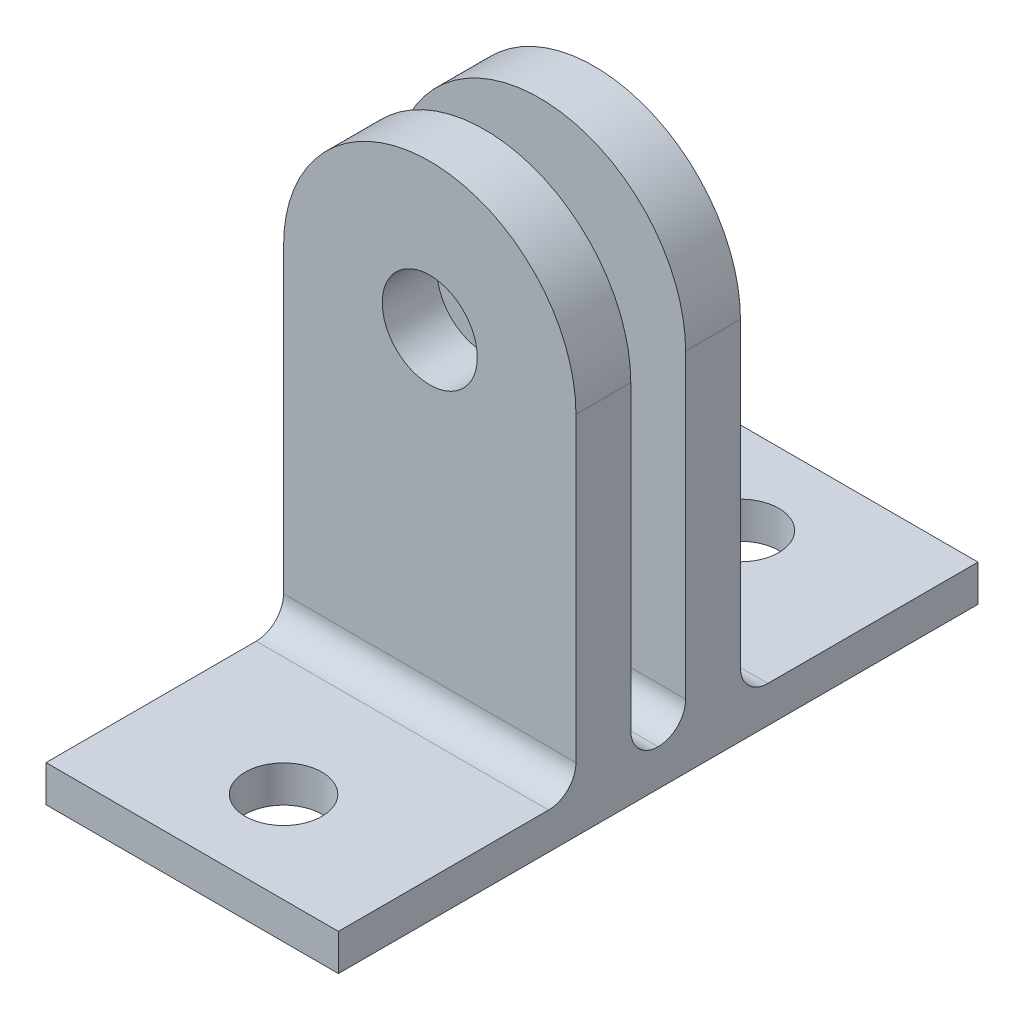
ISO-10303-21;
HEADER;
FILE_DESCRIPTION(('STEP AP214'),'2;1');
FILE_NAME('part.step','',(''),(''),'','','');
FILE_SCHEMA(('AUTOMOTIVE_DESIGN { 1 0 10303 214 1 1 1 1 }'));
ENDSEC;
DATA;
#1=APPLICATION_CONTEXT('core data for automotive mechanical design processes');
#2=APPLICATION_PROTOCOL_DEFINITION('international standard','automotive_design',2000,#1);
#3=PRODUCT_CONTEXT('',#1,'mechanical');
#4=PRODUCT('Part','Part','',(#3));
#5=PRODUCT_RELATED_PRODUCT_CATEGORY('part','',(#4));
#6=PRODUCT_DEFINITION_FORMATION('','',#4);
#7=PRODUCT_DEFINITION_CONTEXT('part definition',#1,'design');
#8=PRODUCT_DEFINITION('design','',#6,#7);
#9=PRODUCT_DEFINITION_SHAPE('','',#8);
#10=(LENGTH_UNIT() NAMED_UNIT(*) SI_UNIT(.MILLI.,.METRE.));
#11=(NAMED_UNIT(*) PLANE_ANGLE_UNIT() SI_UNIT($,.RADIAN.));
#12=(NAMED_UNIT(*) SI_UNIT($,.STERADIAN.) SOLID_ANGLE_UNIT());
#13=UNCERTAINTY_MEASURE_WITH_UNIT(LENGTH_MEASURE(1.E-05),#10,'distance_accuracy_value','');
#14=(GEOMETRIC_REPRESENTATION_CONTEXT(3) GLOBAL_UNCERTAINTY_ASSIGNED_CONTEXT((#13)) GLOBAL_UNIT_ASSIGNED_CONTEXT((#10,
#11,#12)) REPRESENTATION_CONTEXT('',''));
#15=CARTESIAN_POINT('',(0.,0.,0.));
#16=DIRECTION('',(0.,0.,1.));
#17=DIRECTION('',(1.,0.,0.));
#18=AXIS2_PLACEMENT_3D('',#15,#16,#17);
#19=CARTESIAN_POINT('',(0.,2.,0.));
#20=DIRECTION('',(0.,-1.,0.));
#21=DIRECTION('',(0.,0.,-1.));
#22=AXIS2_PLACEMENT_3D('',#19,#20,#21);
#23=PLANE('',#22);
#24=CARTESIAN_POINT('',(0.,2.,-12.5));
#25=DIRECTION('',(0.,1.,0.));
#26=DIRECTION('',(0.,0.,-1.));
#27=AXIS2_PLACEMENT_3D('',#24,#25,#26);
#28=CIRCLE('',#27,2.1);
#29=CARTESIAN_POINT('',(0.,2.,-14.6));
#30=VERTEX_POINT('',#29);
#31=EDGE_CURVE('E522',#30,#30,#28,.T.);
#32=ORIENTED_EDGE('',*,*,#31,.F.);
#33=EDGE_LOOP('',(#32));
#34=FACE_BOUND('',#33,.T.);
#35=DIRECTION('',(0.,0.,1.));
#36=VECTOR('',#35,1.);
#37=CARTESIAN_POINT('',(-8.,2.,17.5));
#38=LINE('',#37,#36);
#39=CARTESIAN_POINT('',(-8.,2.,-17.5));
#40=VERTEX_POINT('',#39);
#41=CARTESIAN_POINT('',(-8.,2.,-6.));
#42=VERTEX_POINT('',#41);
#43=EDGE_CURVE('E207',#40,#42,#38,.T.);
#44=ORIENTED_EDGE('',*,*,#43,.T.);
#45=DIRECTION('',(1.,0.,0.));
#46=VECTOR('',#45,1.);
#47=CARTESIAN_POINT('',(8.,2.,-6.));
#48=LINE('',#47,#46);
#49=CARTESIAN_POINT('',(8.,2.,-6.));
#50=VERTEX_POINT('',#49);
#51=EDGE_CURVE('E238',#42,#50,#48,.T.);
#52=ORIENTED_EDGE('',*,*,#51,.T.);
#53=DIRECTION('',(0.,0.,-1.));
#54=VECTOR('',#53,1.);
#55=CARTESIAN_POINT('',(8.,2.,-17.5));
#56=LINE('',#55,#54);
#57=CARTESIAN_POINT('',(8.,2.,-17.5));
#58=VERTEX_POINT('',#57);
#59=EDGE_CURVE('E212',#50,#58,#56,.T.);
#60=ORIENTED_EDGE('',*,*,#59,.T.);
#61=DIRECTION('',(-1.,0.,0.));
#62=VECTOR('',#61,1.);
#63=CARTESIAN_POINT('',(-8.,2.,-17.5));
#64=LINE('',#63,#62);
#65=EDGE_CURVE('E202',#58,#40,#64,.T.);
#66=ORIENTED_EDGE('',*,*,#65,.T.);
#67=EDGE_LOOP('',(#44,#52,#60,#66));
#68=FACE_BOUND('',#67,.T.);
#69=ADVANCED_FACE('F34',(#34,#68),#23,.F.);
#70=CARTESIAN_POINT('',(0.,2.,12.5));
#71=DIRECTION('',(0.,1.,0.));
#72=DIRECTION('',(0.,0.,1.));
#73=AXIS2_PLACEMENT_3D('',#70,#71,#72);
#74=CIRCLE('',#73,2.1);
#75=CARTESIAN_POINT('',(0.,2.,14.6));
#76=VERTEX_POINT('',#75);
#77=EDGE_CURVE('E516',#76,#76,#74,.T.);
#78=ORIENTED_EDGE('',*,*,#77,.F.);
#79=EDGE_LOOP('',(#78));
#80=FACE_BOUND('',#79,.T.);
#81=CARTESIAN_POINT('',(8.,2.,17.5));
#82=VERTEX_POINT('',#81);
#83=CARTESIAN_POINT('',(8.,2.,6.));
#84=VERTEX_POINT('',#83);
#85=EDGE_CURVE('E213',#82,#84,#56,.T.);
#86=ORIENTED_EDGE('',*,*,#85,.T.);
#87=DIRECTION('',(1.,0.,0.));
#88=VECTOR('',#87,1.);
#89=CARTESIAN_POINT('',(-8.,2.,6.));
#90=LINE('',#89,#88);
#91=CARTESIAN_POINT('',(-8.,2.,6.));
#92=VERTEX_POINT('',#91);
#93=EDGE_CURVE('E245',#84,#92,#90,.F.);
#94=ORIENTED_EDGE('',*,*,#93,.T.);
#95=CARTESIAN_POINT('',(-8.,2.,17.5));
#96=VERTEX_POINT('',#95);
#97=EDGE_CURVE('E205',#92,#96,#38,.T.);
#98=ORIENTED_EDGE('',*,*,#97,.T.);
#99=DIRECTION('',(1.,0.,0.));
#100=VECTOR('',#99,1.);
#101=CARTESIAN_POINT('',(-8.,2.,17.5));
#102=LINE('',#101,#100);
#103=EDGE_CURVE('E210',#96,#82,#102,.T.);
#104=ORIENTED_EDGE('',*,*,#103,.T.);
#105=EDGE_LOOP('',(#86,#94,#98,#104));
#106=FACE_BOUND('',#105,.T.);
#107=ADVANCED_FACE('F305',(#80,#106),#23,.F.);
#108=CARTESIAN_POINT('',(-8.,2.,-17.5));
#109=DIRECTION('',(0.,0.,1.));
#110=DIRECTION('',(1.,0.,0.));
#111=AXIS2_PLACEMENT_3D('',#108,#109,#110);
#112=PLANE('',#111);
#113=DIRECTION('',(-1.,0.,0.));
#114=VECTOR('',#113,1.);
#115=CARTESIAN_POINT('',(-8.,0.,-17.5));
#116=LINE('',#115,#114);
#117=CARTESIAN_POINT('',(8.,0.,-17.5));
#118=VERTEX_POINT('',#117);
#119=CARTESIAN_POINT('',(-8.,0.,-17.5));
#120=VERTEX_POINT('',#119);
#121=EDGE_CURVE('E201',#118,#120,#116,.T.);
#122=ORIENTED_EDGE('',*,*,#121,.T.);
#123=DIRECTION('',(0.,-1.,0.));
#124=VECTOR('',#123,1.);
#125=CARTESIAN_POINT('',(-8.,2.,-17.5));
#126=LINE('',#125,#124);
#127=EDGE_CURVE('E232',#40,#120,#126,.T.);
#128=ORIENTED_EDGE('',*,*,#127,.F.);
#129=ORIENTED_EDGE('',*,*,#65,.F.);
#130=DIRECTION('',(0.,-1.,0.));
#131=VECTOR('',#130,1.);
#132=CARTESIAN_POINT('',(8.,2.,-17.5));
#133=LINE('',#132,#131);
#134=EDGE_CURVE('E216',#58,#118,#133,.T.);
#135=ORIENTED_EDGE('',*,*,#134,.T.);
#136=EDGE_LOOP('',(#122,#128,#129,#135));
#137=FACE_BOUND('',#136,.T.);
#138=ADVANCED_FACE('F289',(#137),#112,.F.);
#139=CARTESIAN_POINT('',(-8.,2.,17.5));
#140=DIRECTION('',(1.,0.,0.));
#141=DIRECTION('',(0.,0.,-1.));
#142=AXIS2_PLACEMENT_3D('',#139,#140,#141);
#143=PLANE('',#142);
#144=DIRECTION('',(0.,0.,1.));
#145=VECTOR('',#144,1.);
#146=CARTESIAN_POINT('',(-8.,0.,17.5));
#147=LINE('',#146,#145);
#148=CARTESIAN_POINT('',(-8.,0.,17.5));
#149=VERTEX_POINT('',#148);
#150=EDGE_CURVE('E219',#120,#149,#147,.T.);
#151=ORIENTED_EDGE('',*,*,#150,.T.);
#152=DIRECTION('',(0.,-1.,0.));
#153=VECTOR('',#152,1.);
#154=CARTESIAN_POINT('',(-8.,2.,17.5));
#155=LINE('',#154,#153);
#156=EDGE_CURVE('E229',#96,#149,#155,.T.);
#157=ORIENTED_EDGE('',*,*,#156,.F.);
#158=ORIENTED_EDGE('',*,*,#97,.F.);
#159=CARTESIAN_POINT('',(-8.,3.5,6.));
#160=DIRECTION('',(1.,0.,0.));
#161=DIRECTION('',(0.,0.,-1.));
#162=AXIS2_PLACEMENT_3D('',#159,#160,#161);
#163=CIRCLE('',#162,1.5);
#164=CARTESIAN_POINT('',(-8.,3.5,4.5));
#165=VERTEX_POINT('',#164);
#166=EDGE_CURVE('E258',#92,#165,#163,.T.);
#167=ORIENTED_EDGE('',*,*,#166,.T.);
#168=DIRECTION('',(0.,-1.,0.));
#169=VECTOR('',#168,1.);
#170=CARTESIAN_POINT('',(-8.,20.,4.5));
#171=LINE('',#170,#169);
#172=CARTESIAN_POINT('',(-8.,20.,4.5));
#173=VERTEX_POINT('',#172);
#174=EDGE_CURVE('E183',#173,#165,#171,.T.);
#175=ORIENTED_EDGE('',*,*,#174,.F.);
#176=DIRECTION('',(0.,0.,-1.));
#177=VECTOR('',#176,1.);
#178=CARTESIAN_POINT('',(-8.,20.,4.5));
#179=LINE('',#178,#177);
#180=CARTESIAN_POINT('',(-8.,20.,1.5));
#181=VERTEX_POINT('',#180);
#182=EDGE_CURVE('E191',#173,#181,#179,.T.);
#183=ORIENTED_EDGE('',*,*,#182,.T.);
#184=DIRECTION('',(0.,-1.,0.));
#185=VECTOR('',#184,1.);
#186=CARTESIAN_POINT('',(-8.,20.,1.5));
#187=LINE('',#186,#185);
#188=CARTESIAN_POINT('',(-8.,3.5,1.5));
#189=VERTEX_POINT('',#188);
#190=EDGE_CURVE('E180',#181,#189,#187,.T.);
#191=ORIENTED_EDGE('',*,*,#190,.T.);
#192=CARTESIAN_POINT('',(-8.,3.5,0.));
#193=DIRECTION('',(1.,0.,0.));
#194=DIRECTION('',(0.,0.,-1.));
#195=AXIS2_PLACEMENT_3D('',#192,#193,#194);
#196=CIRCLE('',#195,1.5);
#197=CARTESIAN_POINT('',(-8.,2.,0.));
#198=VERTEX_POINT('',#197);
#199=EDGE_CURVE('E11',#189,#198,#196,.T.);
#200=ORIENTED_EDGE('',*,*,#199,.T.);
#201=CARTESIAN_POINT('',(-8.,3.5,0.));
#202=DIRECTION('',(1.,0.,0.));
#203=DIRECTION('',(0.,0.,-1.));
#204=AXIS2_PLACEMENT_3D('',#201,#202,#203);
#205=CIRCLE('',#204,1.5);
#206=CARTESIAN_POINT('',(-8.,3.5,-1.5));
#207=VERTEX_POINT('',#206);
#208=EDGE_CURVE('E250',#198,#207,#205,.T.);
#209=ORIENTED_EDGE('',*,*,#208,.T.);
#210=DIRECTION('',(0.,-1.,0.));
#211=VECTOR('',#210,1.);
#212=CARTESIAN_POINT('',(-8.,20.,-1.5));
#213=LINE('',#212,#211);
#214=CARTESIAN_POINT('',(-8.,20.,-1.5));
#215=VERTEX_POINT('',#214);
#216=EDGE_CURVE('E146',#215,#207,#213,.T.);
#217=ORIENTED_EDGE('',*,*,#216,.F.);
#218=DIRECTION('',(0.,0.,1.));
#219=VECTOR('',#218,1.);
#220=CARTESIAN_POINT('',(-8.,20.,-4.5));
#221=LINE('',#220,#219);
#222=CARTESIAN_POINT('',(-8.,20.,-4.5));
#223=VERTEX_POINT('',#222);
#224=EDGE_CURVE('E140',#223,#215,#221,.T.);
#225=ORIENTED_EDGE('',*,*,#224,.F.);
#226=DIRECTION('',(0.,-1.,0.));
#227=VECTOR('',#226,1.);
#228=CARTESIAN_POINT('',(-8.,20.,-4.5));
#229=LINE('',#228,#227);
#230=CARTESIAN_POINT('',(-8.,3.5,-4.5));
#231=VERTEX_POINT('',#230);
#232=EDGE_CURVE('E143',#223,#231,#229,.T.);
#233=ORIENTED_EDGE('',*,*,#232,.T.);
#234=CARTESIAN_POINT('',(-8.,3.5,-6.));
#235=DIRECTION('',(1.,0.,0.));
#236=DIRECTION('',(0.,0.,-1.));
#237=AXIS2_PLACEMENT_3D('',#234,#235,#236);
#238=CIRCLE('',#237,1.5);
#239=EDGE_CURVE('E254',#231,#42,#238,.T.);
#240=ORIENTED_EDGE('',*,*,#239,.T.);
#241=ORIENTED_EDGE('',*,*,#43,.F.);
#242=ORIENTED_EDGE('',*,*,#127,.T.);
#243=EDGE_LOOP('',(#151,#157,#158,#167,#175,#183,#191,#200,#209,#217,#225,#233,#240,#241,#242));
#244=FACE_BOUND('',#243,.T.);
#245=ADVANCED_FACE('F142',(#244),#143,.F.);
#246=CARTESIAN_POINT('',(-8.,2.,17.5));
#247=DIRECTION('',(0.,0.,-1.));
#248=DIRECTION('',(-1.,0.,0.));
#249=AXIS2_PLACEMENT_3D('',#246,#247,#248);
#250=PLANE('',#249);
#251=DIRECTION('',(1.,0.,0.));
#252=VECTOR('',#251,1.);
#253=CARTESIAN_POINT('',(-8.,0.,17.5));
#254=LINE('',#253,#252);
#255=CARTESIAN_POINT('',(8.,0.,17.5));
#256=VERTEX_POINT('',#255);
#257=EDGE_CURVE('E221',#149,#256,#254,.T.);
#258=ORIENTED_EDGE('',*,*,#257,.T.);
#259=DIRECTION('',(0.,-1.,0.));
#260=VECTOR('',#259,1.);
#261=CARTESIAN_POINT('',(8.,2.,17.5));
#262=LINE('',#261,#260);
#263=EDGE_CURVE('E226',#82,#256,#262,.T.);
#264=ORIENTED_EDGE('',*,*,#263,.F.);
#265=ORIENTED_EDGE('',*,*,#103,.F.);
#266=ORIENTED_EDGE('',*,*,#156,.T.);
#267=EDGE_LOOP('',(#258,#264,#265,#266));
#268=FACE_BOUND('',#267,.T.);
#269=ADVANCED_FACE('F297',(#268),#250,.F.);
#270=CARTESIAN_POINT('',(8.,2.,-17.5));
#271=DIRECTION('',(-1.,0.,0.));
#272=DIRECTION('',(0.,0.,1.));
#273=AXIS2_PLACEMENT_3D('',#270,#271,#272);
#274=PLANE('',#273);
#275=DIRECTION('',(0.,0.,-1.));
#276=VECTOR('',#275,1.);
#277=CARTESIAN_POINT('',(8.,0.,-17.5));
#278=LINE('',#277,#276);
#279=EDGE_CURVE('E206',#256,#118,#278,.T.);
#280=ORIENTED_EDGE('',*,*,#279,.T.);
#281=ORIENTED_EDGE('',*,*,#134,.F.);
#282=ORIENTED_EDGE('',*,*,#59,.F.);
#283=CARTESIAN_POINT('',(8.,3.5,-6.));
#284=DIRECTION('',(-1.,0.,0.));
#285=DIRECTION('',(0.,0.,1.));
#286=AXIS2_PLACEMENT_3D('',#283,#284,#285);
#287=CIRCLE('',#286,1.5);
#288=CARTESIAN_POINT('',(8.,3.5,-4.5));
#289=VERTEX_POINT('',#288);
#290=EDGE_CURVE('E252',#50,#289,#287,.T.);
#291=ORIENTED_EDGE('',*,*,#290,.T.);
#292=DIRECTION('',(0.,1.,0.));
#293=VECTOR('',#292,1.);
#294=CARTESIAN_POINT('',(8.,20.,-4.5));
#295=LINE('',#294,#293);
#296=CARTESIAN_POINT('',(8.,20.,-4.5));
#297=VERTEX_POINT('',#296);
#298=EDGE_CURVE('E166',#289,#297,#295,.T.);
#299=ORIENTED_EDGE('',*,*,#298,.T.);
#300=DIRECTION('',(0.,0.,1.));
#301=VECTOR('',#300,1.);
#302=CARTESIAN_POINT('',(8.,20.,-4.5));
#303=LINE('',#302,#301);
#304=CARTESIAN_POINT('',(8.,20.,-1.5));
#305=VERTEX_POINT('',#304);
#306=EDGE_CURVE('E152',#297,#305,#303,.T.);
#307=ORIENTED_EDGE('',*,*,#306,.T.);
#308=DIRECTION('',(0.,1.,0.));
#309=VECTOR('',#308,1.);
#310=CARTESIAN_POINT('',(8.,20.,-1.5));
#311=LINE('',#310,#309);
#312=CARTESIAN_POINT('',(8.,3.5,-1.5));
#313=VERTEX_POINT('',#312);
#314=EDGE_CURVE('E161',#313,#305,#311,.T.);
#315=ORIENTED_EDGE('',*,*,#314,.F.);
#316=CARTESIAN_POINT('',(8.,3.5,0.));
#317=DIRECTION('',(-1.,0.,0.));
#318=DIRECTION('',(0.,0.,1.));
#319=AXIS2_PLACEMENT_3D('',#316,#317,#318);
#320=CIRCLE('',#319,1.5);
#321=CARTESIAN_POINT('',(8.,2.,0.));
#322=VERTEX_POINT('',#321);
#323=EDGE_CURVE('E56',#313,#322,#320,.T.);
#324=ORIENTED_EDGE('',*,*,#323,.T.);
#325=CARTESIAN_POINT('',(8.,3.5,0.));
#326=DIRECTION('',(-1.,0.,0.));
#327=DIRECTION('',(0.,0.,1.));
#328=AXIS2_PLACEMENT_3D('',#325,#326,#327);
#329=CIRCLE('',#328,1.5);
#330=CARTESIAN_POINT('',(8.,3.5,1.5));
#331=VERTEX_POINT('',#330);
#332=EDGE_CURVE('E43',#322,#331,#329,.T.);
#333=ORIENTED_EDGE('',*,*,#332,.T.);
#334=DIRECTION('',(0.,1.,0.));
#335=VECTOR('',#334,1.);
#336=CARTESIAN_POINT('',(8.,20.,1.5));
#337=LINE('',#336,#335);
#338=CARTESIAN_POINT('',(8.,20.,1.5));
#339=VERTEX_POINT('',#338);
#340=EDGE_CURVE('E193',#331,#339,#337,.T.);
#341=ORIENTED_EDGE('',*,*,#340,.T.);
#342=DIRECTION('',(0.,0.,-1.));
#343=VECTOR('',#342,1.);
#344=CARTESIAN_POINT('',(8.,20.,4.5));
#345=LINE('',#344,#343);
#346=CARTESIAN_POINT('',(8.,20.,4.5));
#347=VERTEX_POINT('',#346);
#348=EDGE_CURVE('E198',#347,#339,#345,.T.);
#349=ORIENTED_EDGE('',*,*,#348,.F.);
#350=DIRECTION('',(0.,1.,0.));
#351=VECTOR('',#350,1.);
#352=CARTESIAN_POINT('',(8.,20.,4.5));
#353=LINE('',#352,#351);
#354=CARTESIAN_POINT('',(8.,3.5,4.5));
#355=VERTEX_POINT('',#354);
#356=EDGE_CURVE('E186',#355,#347,#353,.T.);
#357=ORIENTED_EDGE('',*,*,#356,.F.);
#358=CARTESIAN_POINT('',(8.,3.5,6.));
#359=DIRECTION('',(-1.,0.,0.));
#360=DIRECTION('',(0.,0.,1.));
#361=AXIS2_PLACEMENT_3D('',#358,#359,#360);
#362=CIRCLE('',#361,1.5);
#363=EDGE_CURVE('E256',#355,#84,#362,.T.);
#364=ORIENTED_EDGE('',*,*,#363,.T.);
#365=ORIENTED_EDGE('',*,*,#85,.F.);
#366=ORIENTED_EDGE('',*,*,#263,.T.);
#367=EDGE_LOOP('',(#280,#281,#282,#291,#299,#307,#315,#324,#333,#341,#349,#357,#364,#365,#366));
#368=FACE_BOUND('',#367,.T.);
#369=ADVANCED_FACE('F261',(#368),#274,.F.);
#370=CARTESIAN_POINT('',(0.,0.,0.));
#371=DIRECTION('',(0.,-1.,0.));
#372=DIRECTION('',(0.,0.,-1.));
#373=AXIS2_PLACEMENT_3D('',#370,#371,#372);
#374=PLANE('',#373);
#375=CARTESIAN_POINT('',(0.,0.,-12.5));
#376=DIRECTION('',(0.,1.,0.));
#377=DIRECTION('',(0.,0.,-1.));
#378=AXIS2_PLACEMENT_3D('',#375,#376,#377);
#379=CIRCLE('',#378,2.1);
#380=CARTESIAN_POINT('',(0.,0.,-14.6));
#381=VERTEX_POINT('',#380);
#382=EDGE_CURVE('E519',#381,#381,#379,.T.);
#383=ORIENTED_EDGE('',*,*,#382,.T.);
#384=EDGE_LOOP('',(#383));
#385=FACE_BOUND('',#384,.T.);
#386=CARTESIAN_POINT('',(0.,0.,12.5));
#387=DIRECTION('',(0.,1.,0.));
#388=DIRECTION('',(0.,0.,1.));
#389=AXIS2_PLACEMENT_3D('',#386,#387,#388);
#390=CIRCLE('',#389,2.1);
#391=CARTESIAN_POINT('',(0.,0.,14.6));
#392=VERTEX_POINT('',#391);
#393=EDGE_CURVE('E275',#392,#392,#390,.T.);
#394=ORIENTED_EDGE('',*,*,#393,.T.);
#395=EDGE_LOOP('',(#394));
#396=FACE_BOUND('',#395,.T.);
#397=ORIENTED_EDGE('',*,*,#121,.F.);
#398=ORIENTED_EDGE('',*,*,#279,.F.);
#399=ORIENTED_EDGE('',*,*,#257,.F.);
#400=ORIENTED_EDGE('',*,*,#150,.F.);
#401=EDGE_LOOP('',(#397,#398,#399,#400));
#402=FACE_BOUND('',#401,.T.);
#403=ADVANCED_FACE('F300',(#385,#396,#402),#374,.T.);
#404=CARTESIAN_POINT('',(0.,20.,4.5));
#405=DIRECTION('',(0.,0.,-1.));
#406=DIRECTION('',(-1.,0.,0.));
#407=AXIS2_PLACEMENT_3D('',#404,#405,#406);
#408=PLANE('',#407);
#409=ORIENTED_EDGE('',*,*,#174,.T.);
#410=DIRECTION('',(1.,0.,0.));
#411=VECTOR('',#410,1.);
#412=CARTESIAN_POINT('',(8.,3.5,4.5));
#413=LINE('',#412,#411);
#414=EDGE_CURVE('E242',#165,#355,#413,.T.);
#415=ORIENTED_EDGE('',*,*,#414,.T.);
#416=ORIENTED_EDGE('',*,*,#356,.T.);
#417=CARTESIAN_POINT('',(0.,20.,4.5));
#418=DIRECTION('',(0.,0.,1.));
#419=DIRECTION('',(-1.,0.,0.));
#420=AXIS2_PLACEMENT_3D('',#417,#418,#419);
#421=CIRCLE('',#420,8.);
#422=EDGE_CURVE('E189',#347,#173,#421,.T.);
#423=ORIENTED_EDGE('',*,*,#422,.T.);
#424=EDGE_LOOP('',(#409,#415,#416,#423));
#425=FACE_BOUND('',#424,.T.);
#426=CARTESIAN_POINT('',(0.,20.,4.5));
#427=DIRECTION('',(0.,0.,1.));
#428=DIRECTION('',(1.,0.,0.));
#429=AXIS2_PLACEMENT_3D('',#426,#427,#428);
#430=CIRCLE('',#429,2.6);
#431=CARTESIAN_POINT('',(2.6,20.,4.5));
#432=VERTEX_POINT('',#431);
#433=EDGE_CURVE('E177',#432,#432,#430,.T.);
#434=ORIENTED_EDGE('',*,*,#433,.F.);
#435=EDGE_LOOP('',(#434));
#436=FACE_BOUND('',#435,.T.);
#437=ADVANCED_FACE('F311',(#425,#436),#408,.F.);
#438=CARTESIAN_POINT('',(0.,20.,1.5));
#439=DIRECTION('',(0.,0.,-1.));
#440=DIRECTION('',(-1.,0.,0.));
#441=AXIS2_PLACEMENT_3D('',#438,#439,#440);
#442=PLANE('',#441);
#443=ORIENTED_EDGE('',*,*,#340,.F.);
#444=DIRECTION('',(1.,0.,0.));
#445=VECTOR('',#444,1.);
#446=CARTESIAN_POINT('',(0.,3.5,1.5));
#447=LINE('',#446,#445);
#448=EDGE_CURVE('E247',#331,#189,#447,.F.);
#449=ORIENTED_EDGE('',*,*,#448,.T.);
#450=ORIENTED_EDGE('',*,*,#190,.F.);
#451=CARTESIAN_POINT('',(0.,20.,1.5));
#452=DIRECTION('',(0.,0.,1.));
#453=DIRECTION('',(-1.,0.,0.));
#454=AXIS2_PLACEMENT_3D('',#451,#452,#453);
#455=CIRCLE('',#454,8.);
#456=EDGE_CURVE('E187',#339,#181,#455,.T.);
#457=ORIENTED_EDGE('',*,*,#456,.F.);
#458=EDGE_LOOP('',(#443,#449,#450,#457));
#459=FACE_BOUND('',#458,.T.);
#460=CARTESIAN_POINT('',(0.,20.,1.5));
#461=DIRECTION('',(0.,0.,1.));
#462=DIRECTION('',(1.,0.,0.));
#463=AXIS2_PLACEMENT_3D('',#460,#461,#462);
#464=CIRCLE('',#463,2.6);
#465=CARTESIAN_POINT('',(2.6,20.,1.5));
#466=VERTEX_POINT('',#465);
#467=EDGE_CURVE('E151',#466,#466,#464,.T.);
#468=ORIENTED_EDGE('',*,*,#467,.T.);
#469=EDGE_LOOP('',(#468));
#470=FACE_BOUND('',#469,.T.);
#471=ADVANCED_FACE('F268',(#459,#470),#442,.T.);
#472=CARTESIAN_POINT('',(0.,20.,4.5));
#473=DIRECTION('',(0.,0.,-1.));
#474=DIRECTION('',(-1.,0.,0.));
#475=AXIS2_PLACEMENT_3D('',#472,#473,#474);
#476=CYLINDRICAL_SURFACE('',#475,8.);
#477=ORIENTED_EDGE('',*,*,#456,.T.);
#478=ORIENTED_EDGE('',*,*,#182,.F.);
#479=ORIENTED_EDGE('',*,*,#422,.F.);
#480=ORIENTED_EDGE('',*,*,#348,.T.);
#481=EDGE_LOOP('',(#477,#478,#479,#480));
#482=FACE_BOUND('',#481,.T.);
#483=ADVANCED_FACE('F316',(#482),#476,.T.);
#484=CARTESIAN_POINT('',(0.,20.,4.5));
#485=DIRECTION('',(0.,0.,-1.));
#486=DIRECTION('',(-1.,0.,0.));
#487=AXIS2_PLACEMENT_3D('',#484,#485,#486);
#488=CYLINDRICAL_SURFACE('',#487,2.6);
#489=ORIENTED_EDGE('',*,*,#433,.T.);
#490=EDGE_LOOP('',(#489));
#491=FACE_BOUND('',#490,.T.);
#492=ORIENTED_EDGE('',*,*,#467,.F.);
#493=EDGE_LOOP('',(#492));
#494=FACE_BOUND('',#493,.T.);
#495=ADVANCED_FACE('F318',(#491,#494),#488,.F.);
#496=CARTESIAN_POINT('',(0.,20.,-4.5));
#497=DIRECTION('',(0.,0.,1.));
#498=DIRECTION('',(1.,0.,0.));
#499=AXIS2_PLACEMENT_3D('',#496,#497,#498);
#500=CYLINDRICAL_SURFACE('',#499,8.);
#501=CARTESIAN_POINT('',(0.,20.,-1.5));
#502=DIRECTION('',(0.,0.,1.));
#503=DIRECTION('',(-1.,0.,0.));
#504=AXIS2_PLACEMENT_3D('',#501,#502,#503);
#505=CIRCLE('',#504,8.);
#506=EDGE_CURVE('E172',#305,#215,#505,.T.);
#507=ORIENTED_EDGE('',*,*,#506,.F.);
#508=ORIENTED_EDGE('',*,*,#306,.F.);
#509=CARTESIAN_POINT('',(0.,20.,-4.5));
#510=DIRECTION('',(0.,0.,1.));
#511=DIRECTION('',(-1.,0.,0.));
#512=AXIS2_PLACEMENT_3D('',#509,#510,#511);
#513=CIRCLE('',#512,8.);
#514=EDGE_CURVE('E158',#297,#223,#513,.T.);
#515=ORIENTED_EDGE('',*,*,#514,.T.);
#516=ORIENTED_EDGE('',*,*,#224,.T.);
#517=EDGE_LOOP('',(#507,#508,#515,#516));
#518=FACE_BOUND('',#517,.T.);
#519=ADVANCED_FACE('F164',(#518),#500,.T.);
#520=CARTESIAN_POINT('',(0.,20.,-4.5));
#521=DIRECTION('',(0.,0.,1.));
#522=DIRECTION('',(-1.,0.,0.));
#523=AXIS2_PLACEMENT_3D('',#520,#521,#522);
#524=PLANE('',#523);
#525=CARTESIAN_POINT('',(0.,20.,-4.5));
#526=DIRECTION('',(0.,0.,1.));
#527=DIRECTION('',(1.,0.,0.));
#528=AXIS2_PLACEMENT_3D('',#525,#526,#527);
#529=CIRCLE('',#528,2.6);
#530=CARTESIAN_POINT('',(2.6,20.,-4.5));
#531=VERTEX_POINT('',#530);
#532=EDGE_CURVE('E173',#531,#531,#529,.T.);
#533=ORIENTED_EDGE('',*,*,#532,.T.);
#534=EDGE_LOOP('',(#533));
#535=FACE_BOUND('',#534,.T.);
#536=ORIENTED_EDGE('',*,*,#298,.F.);
#537=DIRECTION('',(1.,0.,0.));
#538=VECTOR('',#537,1.);
#539=CARTESIAN_POINT('',(-8.,3.5,-4.5));
#540=LINE('',#539,#538);
#541=EDGE_CURVE('E160',#289,#231,#540,.F.);
#542=ORIENTED_EDGE('',*,*,#541,.T.);
#543=ORIENTED_EDGE('',*,*,#232,.F.);
#544=ORIENTED_EDGE('',*,*,#514,.F.);
#545=EDGE_LOOP('',(#536,#542,#543,#544));
#546=FACE_BOUND('',#545,.T.);
#547=ADVANCED_FACE('F157',(#535,#546),#524,.F.);
#548=CARTESIAN_POINT('',(0.,20.,-1.5));
#549=DIRECTION('',(0.,0.,1.));
#550=DIRECTION('',(-1.,0.,0.));
#551=AXIS2_PLACEMENT_3D('',#548,#549,#550);
#552=PLANE('',#551);
#553=CARTESIAN_POINT('',(0.,20.,-1.5));
#554=DIRECTION('',(0.,0.,1.));
#555=DIRECTION('',(1.,0.,0.));
#556=AXIS2_PLACEMENT_3D('',#553,#554,#555);
#557=CIRCLE('',#556,2.6);
#558=CARTESIAN_POINT('',(2.6,20.,-1.5));
#559=VERTEX_POINT('',#558);
#560=EDGE_CURVE('E274',#559,#559,#557,.T.);
#561=ORIENTED_EDGE('',*,*,#560,.F.);
#562=EDGE_LOOP('',(#561));
#563=FACE_BOUND('',#562,.T.);
#564=ORIENTED_EDGE('',*,*,#216,.T.);
#565=DIRECTION('',(1.,0.,0.));
#566=VECTOR('',#565,1.);
#567=CARTESIAN_POINT('',(0.,3.5,-1.5));
#568=LINE('',#567,#566);
#569=EDGE_CURVE('E235',#207,#313,#568,.T.);
#570=ORIENTED_EDGE('',*,*,#569,.T.);
#571=ORIENTED_EDGE('',*,*,#314,.T.);
#572=ORIENTED_EDGE('',*,*,#506,.T.);
#573=EDGE_LOOP('',(#564,#570,#571,#572));
#574=FACE_BOUND('',#573,.T.);
#575=ADVANCED_FACE('F279',(#563,#574),#552,.T.);
#576=CARTESIAN_POINT('',(0.,20.,-4.5));
#577=DIRECTION('',(0.,0.,1.));
#578=DIRECTION('',(1.,0.,0.));
#579=AXIS2_PLACEMENT_3D('',#576,#577,#578);
#580=CYLINDRICAL_SURFACE('',#579,2.6);
#581=ORIENTED_EDGE('',*,*,#532,.F.);
#582=EDGE_LOOP('',(#581));
#583=FACE_BOUND('',#582,.T.);
#584=ORIENTED_EDGE('',*,*,#560,.T.);
#585=EDGE_LOOP('',(#584));
#586=FACE_BOUND('',#585,.T.);
#587=ADVANCED_FACE('F351',(#583,#586),#580,.F.);
#588=CARTESIAN_POINT('',(0.,3.5,0.));
#589=DIRECTION('',(1.,0.,0.));
#590=DIRECTION('',(0.,0.,-1.));
#591=AXIS2_PLACEMENT_3D('',#588,#589,#590);
#592=CYLINDRICAL_SURFACE('',#591,1.5);
#593=DIRECTION('',(1.,0.,0.));
#594=VECTOR('',#593,1.);
#595=CARTESIAN_POINT('',(0.,2.,0.));
#596=LINE('',#595,#594);
#597=EDGE_CURVE('E38',#198,#322,#596,.T.);
#598=ORIENTED_EDGE('',*,*,#597,.F.);
#599=ORIENTED_EDGE('',*,*,#199,.F.);
#600=ORIENTED_EDGE('',*,*,#448,.F.);
#601=ORIENTED_EDGE('',*,*,#332,.F.);
#602=EDGE_LOOP('',(#598,#599,#600,#601));
#603=FACE_BOUND('',#602,.T.);
#604=ADVANCED_FACE('F271',(#603),#592,.F.);
#605=CARTESIAN_POINT('',(0.,3.5,0.));
#606=DIRECTION('',(1.,0.,0.));
#607=DIRECTION('',(0.,0.,-1.));
#608=AXIS2_PLACEMENT_3D('',#605,#606,#607);
#609=CYLINDRICAL_SURFACE('',#608,1.5);
#610=ORIENTED_EDGE('',*,*,#208,.F.);
#611=ORIENTED_EDGE('',*,*,#597,.T.);
#612=ORIENTED_EDGE('',*,*,#323,.F.);
#613=ORIENTED_EDGE('',*,*,#569,.F.);
#614=EDGE_LOOP('',(#610,#611,#612,#613));
#615=FACE_BOUND('',#614,.T.);
#616=ADVANCED_FACE('F277',(#615),#609,.F.);
#617=CARTESIAN_POINT('',(0.,3.5,-6.));
#618=DIRECTION('',(-1.,0.,0.));
#619=DIRECTION('',(0.,0.,1.));
#620=AXIS2_PLACEMENT_3D('',#617,#618,#619);
#621=CYLINDRICAL_SURFACE('',#620,1.5);
#622=ORIENTED_EDGE('',*,*,#239,.F.);
#623=ORIENTED_EDGE('',*,*,#541,.F.);
#624=ORIENTED_EDGE('',*,*,#290,.F.);
#625=ORIENTED_EDGE('',*,*,#51,.F.);
#626=EDGE_LOOP('',(#622,#623,#624,#625));
#627=FACE_BOUND('',#626,.T.);
#628=ADVANCED_FACE('F282',(#627),#621,.F.);
#629=CARTESIAN_POINT('',(0.,3.5,6.));
#630=DIRECTION('',(-1.,0.,0.));
#631=DIRECTION('',(0.,0.,1.));
#632=AXIS2_PLACEMENT_3D('',#629,#630,#631);
#633=CYLINDRICAL_SURFACE('',#632,1.5);
#634=ORIENTED_EDGE('',*,*,#166,.F.);
#635=ORIENTED_EDGE('',*,*,#93,.F.);
#636=ORIENTED_EDGE('',*,*,#363,.F.);
#637=ORIENTED_EDGE('',*,*,#414,.F.);
#638=EDGE_LOOP('',(#634,#635,#636,#637));
#639=FACE_BOUND('',#638,.T.);
#640=ADVANCED_FACE('F36',(#639),#633,.F.);
#641=CARTESIAN_POINT('',(0.,0.,12.5));
#642=DIRECTION('',(0.,1.,0.));
#643=DIRECTION('',(0.,0.,1.));
#644=AXIS2_PLACEMENT_3D('',#641,#642,#643);
#645=CYLINDRICAL_SURFACE('',#644,2.1);
#646=ORIENTED_EDGE('',*,*,#393,.F.);
#647=EDGE_LOOP('',(#646));
#648=FACE_BOUND('',#647,.T.);
#649=ORIENTED_EDGE('',*,*,#77,.T.);
#650=EDGE_LOOP('',(#649));
#651=FACE_BOUND('',#650,.T.);
#652=ADVANCED_FACE('F356',(#648,#651),#645,.F.);
#653=CARTESIAN_POINT('',(0.,0.,-12.5));
#654=DIRECTION('',(0.,1.,0.));
#655=DIRECTION('',(0.,0.,1.));
#656=AXIS2_PLACEMENT_3D('',#653,#654,#655);
#657=CYLINDRICAL_SURFACE('',#656,2.1);
#658=ORIENTED_EDGE('',*,*,#382,.F.);
#659=EDGE_LOOP('',(#658));
#660=FACE_BOUND('',#659,.T.);
#661=ORIENTED_EDGE('',*,*,#31,.T.);
#662=EDGE_LOOP('',(#661));
#663=FACE_BOUND('',#662,.T.);
#664=ADVANCED_FACE('F359',(#660,#663),#657,.F.);
#665=CLOSED_SHELL('',(#69,#107,#138,#245,#269,#369,#403,#437,#471,#483,#495,#519,#547,#575,#587,
#604,#616,#628,#640,#652,#664));
#666=MANIFOLD_SOLID_BREP('B2',#665);
#667=ADVANCED_BREP_SHAPE_REPRESENTATION('',(#18,#666),#14);
#668=SHAPE_DEFINITION_REPRESENTATION(#9,#667);
ENDSEC;
END-ISO-10303-21;
